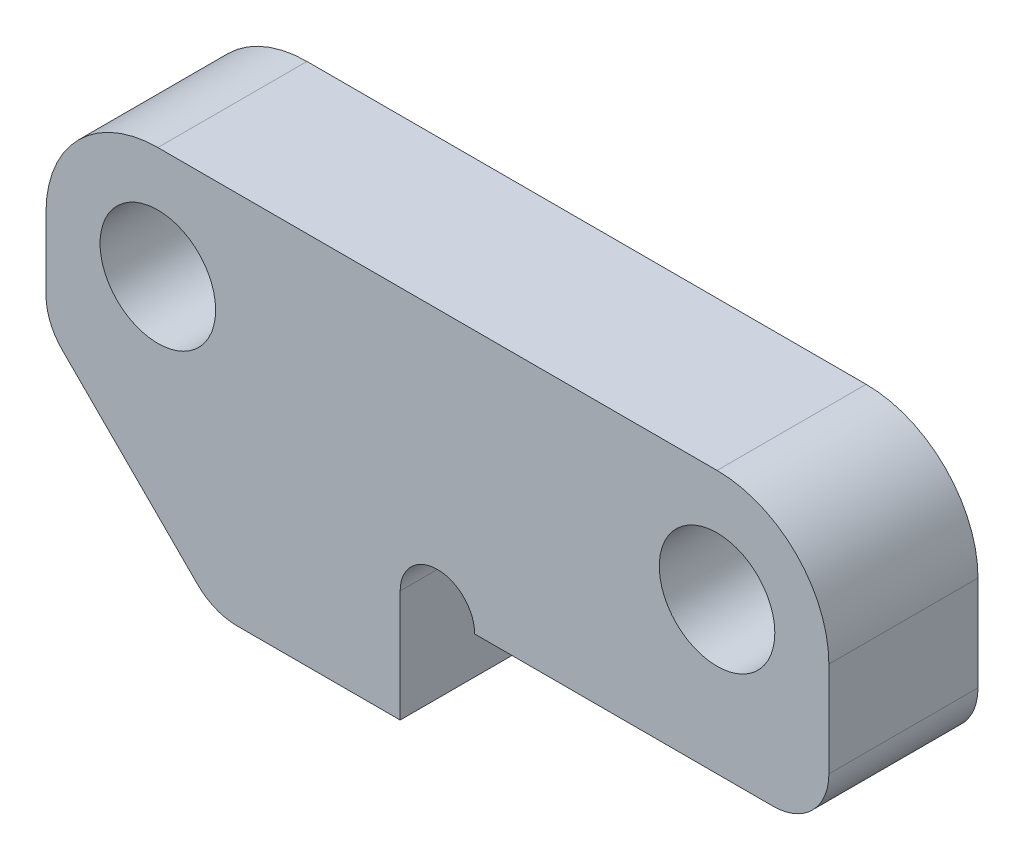
ISO-10303-21;
HEADER;
FILE_DESCRIPTION(('STEP AP214'),'2;1');
FILE_NAME('part.step','',(''),(''),'','','');
FILE_SCHEMA(('AUTOMOTIVE_DESIGN { 1 0 10303 214 1 1 1 1 }'));
ENDSEC;
DATA;
#1=APPLICATION_CONTEXT('core data for automotive mechanical design processes');
#2=APPLICATION_PROTOCOL_DEFINITION('international standard','automotive_design',2000,#1);
#3=PRODUCT_CONTEXT('',#1,'mechanical');
#4=PRODUCT('Part','Part','',(#3));
#5=PRODUCT_RELATED_PRODUCT_CATEGORY('part','',(#4));
#6=PRODUCT_DEFINITION_FORMATION('','',#4);
#7=PRODUCT_DEFINITION_CONTEXT('part definition',#1,'design');
#8=PRODUCT_DEFINITION('design','',#6,#7);
#9=PRODUCT_DEFINITION_SHAPE('','',#8);
#10=(LENGTH_UNIT() NAMED_UNIT(*) SI_UNIT(.MILLI.,.METRE.));
#11=(NAMED_UNIT(*) PLANE_ANGLE_UNIT() SI_UNIT($,.RADIAN.));
#12=(NAMED_UNIT(*) SI_UNIT($,.STERADIAN.) SOLID_ANGLE_UNIT());
#13=UNCERTAINTY_MEASURE_WITH_UNIT(LENGTH_MEASURE(1.E-05),#10,'distance_accuracy_value','');
#14=(GEOMETRIC_REPRESENTATION_CONTEXT(3) GLOBAL_UNCERTAINTY_ASSIGNED_CONTEXT((#13)) GLOBAL_UNIT_ASSIGNED_CONTEXT((#10,
#11,#12)) REPRESENTATION_CONTEXT('',''));
#15=CARTESIAN_POINT('',(0.,0.,0.));
#16=DIRECTION('',(0.,0.,1.));
#17=DIRECTION('',(1.,0.,0.));
#18=AXIS2_PLACEMENT_3D('',#15,#16,#17);
#19=CARTESIAN_POINT('',(0.,0.,2.));
#20=DIRECTION('',(0.,0.,-1.));
#21=DIRECTION('',(-1.,0.,0.));
#22=AXIS2_PLACEMENT_3D('',#19,#20,#21);
#23=PLANE('',#22);
#24=DIRECTION('',(0.,1.,0.));
#25=VECTOR('',#24,1.);
#26=CARTESIAN_POINT('',(-0.999999999999999,-7.05,2.));
#27=LINE('',#26,#25);
#28=CARTESIAN_POINT('',(-0.999999999999999,-10.05,2.));
#29=VERTEX_POINT('',#28);
#30=CARTESIAN_POINT('',(-0.999999999999999,-7.05,2.));
#31=VERTEX_POINT('',#30);
#32=EDGE_CURVE('E135',#29,#31,#27,.T.);
#33=ORIENTED_EDGE('',*,*,#32,.T.);
#34=CARTESIAN_POINT('',(0.,-7.05,2.));
#35=DIRECTION('',(0.,0.,1.));
#36=DIRECTION('',(1.,0.,0.));
#37=AXIS2_PLACEMENT_3D('',#34,#35,#36);
#38=CIRCLE('',#37,1.);
#39=CARTESIAN_POINT('',(1.,-7.05,2.));
#40=VERTEX_POINT('',#39);
#41=EDGE_CURVE('E126',#40,#31,#38,.T.);
#42=ORIENTED_EDGE('',*,*,#41,.F.);
#43=DIRECTION('',(1.,0.,0.));
#44=VECTOR('',#43,1.);
#45=CARTESIAN_POINT('',(10.5,-7.05,2.));
#46=LINE('',#45,#44);
#47=CARTESIAN_POINT('',(9.,-7.05,2.));
#48=VERTEX_POINT('',#47);
#49=EDGE_CURVE('E132',#40,#48,#46,.T.);
#50=ORIENTED_EDGE('',*,*,#49,.T.);
#51=CARTESIAN_POINT('',(9.,-5.55,2.));
#52=DIRECTION('',(0.,0.,-1.));
#53=DIRECTION('',(-1.,0.,0.));
#54=AXIS2_PLACEMENT_3D('',#51,#52,#53);
#55=CIRCLE('',#54,1.5);
#56=CARTESIAN_POINT('',(10.5,-5.55,2.));
#57=VERTEX_POINT('',#56);
#58=EDGE_CURVE('E211',#48,#57,#55,.F.);
#59=ORIENTED_EDGE('',*,*,#58,.T.);
#60=DIRECTION('',(0.,1.,0.));
#61=VECTOR('',#60,1.);
#62=CARTESIAN_POINT('',(10.5,0.,2.));
#63=LINE('',#62,#61);
#64=CARTESIAN_POINT('',(10.5,-3.,2.));
#65=VERTEX_POINT('',#64);
#66=EDGE_CURVE('E142',#57,#65,#63,.T.);
#67=ORIENTED_EDGE('',*,*,#66,.T.);
#68=CARTESIAN_POINT('',(7.5,-3.,2.));
#69=DIRECTION('',(0.,0.,-1.));
#70=DIRECTION('',(-1.,0.,0.));
#71=AXIS2_PLACEMENT_3D('',#68,#69,#70);
#72=CIRCLE('',#71,3.);
#73=CARTESIAN_POINT('',(7.5,0.,2.));
#74=VERTEX_POINT('',#73);
#75=EDGE_CURVE('E190',#65,#74,#72,.F.);
#76=ORIENTED_EDGE('',*,*,#75,.T.);
#77=DIRECTION('',(-1.,0.,0.));
#78=VECTOR('',#77,1.);
#79=CARTESIAN_POINT('',(-10.5,0.,2.));
#80=LINE('',#79,#78);
#81=CARTESIAN_POINT('',(-7.5,0.,2.));
#82=VERTEX_POINT('',#81);
#83=EDGE_CURVE('E144',#74,#82,#80,.T.);
#84=ORIENTED_EDGE('',*,*,#83,.T.);
#85=CARTESIAN_POINT('',(-7.5,-3.,2.));
#86=DIRECTION('',(0.,0.,-1.));
#87=DIRECTION('',(-1.,0.,0.));
#88=AXIS2_PLACEMENT_3D('',#85,#86,#87);
#89=CIRCLE('',#88,3.);
#90=CARTESIAN_POINT('',(-10.5,-3.,2.));
#91=VERTEX_POINT('',#90);
#92=EDGE_CURVE('E192',#82,#91,#89,.F.);
#93=ORIENTED_EDGE('',*,*,#92,.T.);
#94=DIRECTION('',(0.,-1.,0.));
#95=VECTOR('',#94,1.);
#96=CARTESIAN_POINT('',(-10.5,-5.55000000000002,2.));
#97=LINE('',#96,#95);
#98=CARTESIAN_POINT('',(-10.5,-4.92867965644037,2.));
#99=VERTEX_POINT('',#98);
#100=EDGE_CURVE('E172',#91,#99,#97,.T.);
#101=ORIENTED_EDGE('',*,*,#100,.T.);
#102=CARTESIAN_POINT('',(-9.,-4.92867965644037,2.));
#103=DIRECTION('',(0.,0.,-1.));
#104=DIRECTION('',(-1.,0.,0.));
#105=AXIS2_PLACEMENT_3D('',#102,#103,#104);
#106=CIRCLE('',#105,1.5);
#107=CARTESIAN_POINT('',(-10.0606601717798,-5.98933982822019,2.));
#108=VERTEX_POINT('',#107);
#109=EDGE_CURVE('E208',#99,#108,#106,.F.);
#110=ORIENTED_EDGE('',*,*,#109,.T.);
#111=DIRECTION('',(0.707106781186549,-0.707106781186546,0.));
#112=VECTOR('',#111,1.);
#113=CARTESIAN_POINT('',(-6.,-10.05,2.));
#114=LINE('',#113,#112);
#115=CARTESIAN_POINT('',(-6.43933982822018,-9.61066017177983,2.));
#116=VERTEX_POINT('',#115);
#117=EDGE_CURVE('E231',#108,#116,#114,.T.);
#118=ORIENTED_EDGE('',*,*,#117,.T.);
#119=CARTESIAN_POINT('',(-5.37867965644036,-8.55,2.));
#120=DIRECTION('',(0.,0.,-1.));
#121=DIRECTION('',(-1.,0.,0.));
#122=AXIS2_PLACEMENT_3D('',#119,#120,#121);
#123=CIRCLE('',#122,1.5);
#124=CARTESIAN_POINT('',(-5.37867965644036,-10.05,2.));
#125=VERTEX_POINT('',#124);
#126=EDGE_CURVE('E54',#116,#125,#123,.F.);
#127=ORIENTED_EDGE('',*,*,#126,.T.);
#128=DIRECTION('',(1.,0.,0.));
#129=VECTOR('',#128,1.);
#130=CARTESIAN_POINT('',(-0.999999999999999,-10.05,2.));
#131=LINE('',#130,#129);
#132=EDGE_CURVE('E146',#125,#29,#131,.T.);
#133=ORIENTED_EDGE('',*,*,#132,.T.);
#134=EDGE_LOOP('',(#33,#42,#50,#59,#67,#76,#84,#93,#101,#110,#118,#127,#133));
#135=FACE_BOUND('',#134,.T.);
#136=CARTESIAN_POINT('',(-7.5,-3.,2.));
#137=DIRECTION('',(0.,0.,1.));
#138=DIRECTION('',(1.,0.,0.));
#139=AXIS2_PLACEMENT_3D('',#136,#137,#138);
#140=CIRCLE('',#139,1.55);
#141=CARTESIAN_POINT('',(-5.95,-3.,2.));
#142=VERTEX_POINT('',#141);
#143=EDGE_CURVE('E157',#142,#142,#140,.T.);
#144=ORIENTED_EDGE('',*,*,#143,.F.);
#145=EDGE_LOOP('',(#144));
#146=FACE_BOUND('',#145,.T.);
#147=CARTESIAN_POINT('',(7.5,-3.,2.));
#148=DIRECTION('',(0.,0.,1.));
#149=DIRECTION('',(1.,0.,0.));
#150=AXIS2_PLACEMENT_3D('',#147,#148,#149);
#151=CIRCLE('',#150,1.55);
#152=CARTESIAN_POINT('',(9.05,-3.,2.));
#153=VERTEX_POINT('',#152);
#154=EDGE_CURVE('E254',#153,#153,#151,.T.);
#155=ORIENTED_EDGE('',*,*,#154,.F.);
#156=EDGE_LOOP('',(#155));
#157=FACE_BOUND('',#156,.T.);
#158=ADVANCED_FACE('F32',(#135,#146,#157),#23,.F.);
#159=CARTESIAN_POINT('',(0.,0.,-2.));
#160=DIRECTION('',(0.,0.,-1.));
#161=DIRECTION('',(-1.,0.,0.));
#162=AXIS2_PLACEMENT_3D('',#159,#160,#161);
#163=PLANE('',#162);
#164=CARTESIAN_POINT('',(0.,-7.05,-2.));
#165=DIRECTION('',(0.,0.,1.));
#166=DIRECTION('',(1.,0.,0.));
#167=AXIS2_PLACEMENT_3D('',#164,#165,#166);
#168=CIRCLE('',#167,1.);
#169=CARTESIAN_POINT('',(1.,-7.05,-2.));
#170=VERTEX_POINT('',#169);
#171=CARTESIAN_POINT('',(-0.999999999999999,-7.05,-2.));
#172=VERTEX_POINT('',#171);
#173=EDGE_CURVE('E47',#170,#172,#168,.T.);
#174=ORIENTED_EDGE('',*,*,#173,.T.);
#175=DIRECTION('',(0.,1.,0.));
#176=VECTOR('',#175,1.);
#177=CARTESIAN_POINT('',(-0.999999999999999,-7.05,-2.));
#178=LINE('',#177,#176);
#179=CARTESIAN_POINT('',(-0.999999999999999,-10.05,-2.));
#180=VERTEX_POINT('',#179);
#181=EDGE_CURVE('E162',#180,#172,#178,.T.);
#182=ORIENTED_EDGE('',*,*,#181,.F.);
#183=DIRECTION('',(1.,0.,0.));
#184=VECTOR('',#183,1.);
#185=CARTESIAN_POINT('',(-0.999999999999999,-10.05,-2.));
#186=LINE('',#185,#184);
#187=CARTESIAN_POINT('',(-5.37867965644036,-10.05,-2.));
#188=VERTEX_POINT('',#187);
#189=EDGE_CURVE('E160',#188,#180,#186,.T.);
#190=ORIENTED_EDGE('',*,*,#189,.F.);
#191=CARTESIAN_POINT('',(-5.37867965644036,-8.55,-2.));
#192=DIRECTION('',(0.,0.,-1.));
#193=DIRECTION('',(-1.,0.,0.));
#194=AXIS2_PLACEMENT_3D('',#191,#192,#193);
#195=CIRCLE('',#194,1.5);
#196=CARTESIAN_POINT('',(-6.43933982822018,-9.61066017177983,-2.));
#197=VERTEX_POINT('',#196);
#198=EDGE_CURVE('E202',#188,#197,#195,.T.);
#199=ORIENTED_EDGE('',*,*,#198,.T.);
#200=DIRECTION('',(0.707106781186549,-0.707106781186546,0.));
#201=VECTOR('',#200,1.);
#202=CARTESIAN_POINT('',(-6.,-10.05,-2.));
#203=LINE('',#202,#201);
#204=CARTESIAN_POINT('',(-10.0606601717798,-5.98933982822019,-2.));
#205=VERTEX_POINT('',#204);
#206=EDGE_CURVE('E156',#205,#197,#203,.T.);
#207=ORIENTED_EDGE('',*,*,#206,.F.);
#208=CARTESIAN_POINT('',(-9.,-4.92867965644037,-2.));
#209=DIRECTION('',(0.,0.,-1.));
#210=DIRECTION('',(-1.,0.,0.));
#211=AXIS2_PLACEMENT_3D('',#208,#209,#210);
#212=CIRCLE('',#211,1.5);
#213=CARTESIAN_POINT('',(-10.5,-4.92867965644037,-2.));
#214=VERTEX_POINT('',#213);
#215=EDGE_CURVE('E200',#205,#214,#212,.T.);
#216=ORIENTED_EDGE('',*,*,#215,.T.);
#217=DIRECTION('',(0.,-1.,0.));
#218=VECTOR('',#217,1.);
#219=CARTESIAN_POINT('',(-10.5,-5.55000000000002,-2.));
#220=LINE('',#219,#218);
#221=CARTESIAN_POINT('',(-10.5,-3.,-2.));
#222=VERTEX_POINT('',#221);
#223=EDGE_CURVE('E153',#222,#214,#220,.T.);
#224=ORIENTED_EDGE('',*,*,#223,.F.);
#225=CARTESIAN_POINT('',(-7.5,-3.,-2.));
#226=DIRECTION('',(0.,0.,-1.));
#227=DIRECTION('',(-1.,0.,0.));
#228=AXIS2_PLACEMENT_3D('',#225,#226,#227);
#229=CIRCLE('',#228,3.);
#230=CARTESIAN_POINT('',(-7.5,0.,-2.));
#231=VERTEX_POINT('',#230);
#232=EDGE_CURVE('E183',#222,#231,#229,.T.);
#233=ORIENTED_EDGE('',*,*,#232,.T.);
#234=DIRECTION('',(-1.,0.,0.));
#235=VECTOR('',#234,1.);
#236=CARTESIAN_POINT('',(-10.5,0.,-2.));
#237=LINE('',#236,#235);
#238=CARTESIAN_POINT('',(7.5,0.,-2.));
#239=VERTEX_POINT('',#238);
#240=EDGE_CURVE('E169',#239,#231,#237,.T.);
#241=ORIENTED_EDGE('',*,*,#240,.F.);
#242=CARTESIAN_POINT('',(7.5,-3.,-2.));
#243=DIRECTION('',(0.,0.,-1.));
#244=DIRECTION('',(-1.,0.,0.));
#245=AXIS2_PLACEMENT_3D('',#242,#243,#244);
#246=CIRCLE('',#245,3.);
#247=CARTESIAN_POINT('',(10.5,-3.,-2.));
#248=VERTEX_POINT('',#247);
#249=EDGE_CURVE('E180',#239,#248,#246,.T.);
#250=ORIENTED_EDGE('',*,*,#249,.T.);
#251=DIRECTION('',(0.,1.,0.));
#252=VECTOR('',#251,1.);
#253=CARTESIAN_POINT('',(10.5,0.,-2.));
#254=LINE('',#253,#252);
#255=CARTESIAN_POINT('',(10.5,-5.55,-2.));
#256=VERTEX_POINT('',#255);
#257=EDGE_CURVE('E167',#256,#248,#254,.T.);
#258=ORIENTED_EDGE('',*,*,#257,.F.);
#259=CARTESIAN_POINT('',(9.,-5.55,-2.));
#260=DIRECTION('',(0.,0.,-1.));
#261=DIRECTION('',(-1.,0.,0.));
#262=AXIS2_PLACEMENT_3D('',#259,#260,#261);
#263=CIRCLE('',#262,1.5);
#264=CARTESIAN_POINT('',(9.,-7.05,-2.));
#265=VERTEX_POINT('',#264);
#266=EDGE_CURVE('E204',#256,#265,#263,.T.);
#267=ORIENTED_EDGE('',*,*,#266,.T.);
#268=DIRECTION('',(1.,0.,0.));
#269=VECTOR('',#268,1.);
#270=CARTESIAN_POINT('',(10.5,-7.05,-2.));
#271=LINE('',#270,#269);
#272=EDGE_CURVE('E165',#170,#265,#271,.T.);
#273=ORIENTED_EDGE('',*,*,#272,.F.);
#274=EDGE_LOOP('',(#174,#182,#190,#199,#207,#216,#224,#233,#241,#250,#258,#267,#273));
#275=FACE_BOUND('',#274,.T.);
#276=CARTESIAN_POINT('',(-7.5,-3.,-2.));
#277=DIRECTION('',(0.,0.,1.));
#278=DIRECTION('',(1.,0.,0.));
#279=AXIS2_PLACEMENT_3D('',#276,#277,#278);
#280=CIRCLE('',#279,1.55);
#281=CARTESIAN_POINT('',(-5.95,-3.,-2.));
#282=VERTEX_POINT('',#281);
#283=EDGE_CURVE('E251',#282,#282,#280,.T.);
#284=ORIENTED_EDGE('',*,*,#283,.T.);
#285=EDGE_LOOP('',(#284));
#286=FACE_BOUND('',#285,.T.);
#287=CARTESIAN_POINT('',(7.5,-3.,-2.));
#288=DIRECTION('',(0.,0.,1.));
#289=DIRECTION('',(1.,0.,0.));
#290=AXIS2_PLACEMENT_3D('',#287,#288,#289);
#291=CIRCLE('',#290,1.55);
#292=CARTESIAN_POINT('',(9.05,-3.,-2.));
#293=VERTEX_POINT('',#292);
#294=EDGE_CURVE('E257',#293,#293,#291,.T.);
#295=ORIENTED_EDGE('',*,*,#294,.T.);
#296=EDGE_LOOP('',(#295));
#297=FACE_BOUND('',#296,.T.);
#298=ADVANCED_FACE('F239',(#275,#286,#297),#163,.T.);
#299=CARTESIAN_POINT('',(-10.5,-5.55000000000002,2.));
#300=DIRECTION('',(1.,0.,0.));
#301=DIRECTION('',(0.,0.,-1.));
#302=AXIS2_PLACEMENT_3D('',#299,#300,#301);
#303=PLANE('',#302);
#304=ORIENTED_EDGE('',*,*,#223,.T.);
#305=DIRECTION('',(0.,0.,-1.));
#306=VECTOR('',#305,1.);
#307=CARTESIAN_POINT('',(-10.5,-4.92867965644037,2.));
#308=LINE('',#307,#306);
#309=EDGE_CURVE('E40',#214,#99,#308,.F.);
#310=ORIENTED_EDGE('',*,*,#309,.T.);
#311=ORIENTED_EDGE('',*,*,#100,.F.);
#312=DIRECTION('',(0.,0.,-1.));
#313=VECTOR('',#312,1.);
#314=CARTESIAN_POINT('',(-10.5,-3.,2.));
#315=LINE('',#314,#313);
#316=EDGE_CURVE('E177',#91,#222,#315,.T.);
#317=ORIENTED_EDGE('',*,*,#316,.T.);
#318=EDGE_LOOP('',(#304,#310,#311,#317));
#319=FACE_BOUND('',#318,.T.);
#320=ADVANCED_FACE('F224',(#319),#303,.F.);
#321=CARTESIAN_POINT('',(-6.,-10.05,2.));
#322=DIRECTION('',(0.707106781186546,0.707106781186549,0.));
#323=DIRECTION('',(-0.707106781186549,0.707106781186546,0.));
#324=AXIS2_PLACEMENT_3D('',#321,#322,#323);
#325=PLANE('',#324);
#326=ORIENTED_EDGE('',*,*,#206,.T.);
#327=DIRECTION('',(0.,0.,-1.));
#328=VECTOR('',#327,1.);
#329=CARTESIAN_POINT('',(-6.43933982822018,-9.61066017177983,2.));
#330=LINE('',#329,#328);
#331=EDGE_CURVE('E219',#197,#116,#330,.F.);
#332=ORIENTED_EDGE('',*,*,#331,.T.);
#333=ORIENTED_EDGE('',*,*,#117,.F.);
#334=DIRECTION('',(0.,0.,-1.));
#335=VECTOR('',#334,1.);
#336=CARTESIAN_POINT('',(-10.0606601717798,-5.98933982822019,2.));
#337=LINE('',#336,#335);
#338=EDGE_CURVE('E216',#108,#205,#337,.T.);
#339=ORIENTED_EDGE('',*,*,#338,.T.);
#340=EDGE_LOOP('',(#326,#332,#333,#339));
#341=FACE_BOUND('',#340,.T.);
#342=ADVANCED_FACE('F236',(#341),#325,.F.);
#343=CARTESIAN_POINT('',(-0.999999999999999,-10.05,2.));
#344=DIRECTION('',(0.,1.,0.));
#345=DIRECTION('',(0.,0.,1.));
#346=AXIS2_PLACEMENT_3D('',#343,#344,#345);
#347=PLANE('',#346);
#348=ORIENTED_EDGE('',*,*,#132,.F.);
#349=DIRECTION('',(0.,0.,-1.));
#350=VECTOR('',#349,1.);
#351=CARTESIAN_POINT('',(-5.37867965644036,-10.05,2.));
#352=LINE('',#351,#350);
#353=EDGE_CURVE('E213',#125,#188,#352,.T.);
#354=ORIENTED_EDGE('',*,*,#353,.T.);
#355=ORIENTED_EDGE('',*,*,#189,.T.);
#356=DIRECTION('',(0.,0.,-1.));
#357=VECTOR('',#356,1.);
#358=CARTESIAN_POINT('',(-0.999999999999999,-10.05,2.));
#359=LINE('',#358,#357);
#360=EDGE_CURVE('E174',#29,#180,#359,.T.);
#361=ORIENTED_EDGE('',*,*,#360,.F.);
#362=EDGE_LOOP('',(#348,#354,#355,#361));
#363=FACE_BOUND('',#362,.T.);
#364=ADVANCED_FACE('F247',(#363),#347,.F.);
#365=CARTESIAN_POINT('',(-0.999999999999999,-7.05,2.));
#366=DIRECTION('',(-1.,0.,0.));
#367=DIRECTION('',(0.,-1.,0.));
#368=AXIS2_PLACEMENT_3D('',#365,#366,#367);
#369=PLANE('',#368);
#370=ORIENTED_EDGE('',*,*,#181,.T.);
#371=DIRECTION('',(0.,0.,-1.));
#372=VECTOR('',#371,1.);
#373=CARTESIAN_POINT('',(-0.999999999999999,-7.05,2.));
#374=LINE('',#373,#372);
#375=EDGE_CURVE('E152',#31,#172,#374,.T.);
#376=ORIENTED_EDGE('',*,*,#375,.F.);
#377=ORIENTED_EDGE('',*,*,#32,.F.);
#378=ORIENTED_EDGE('',*,*,#360,.T.);
#379=EDGE_LOOP('',(#370,#376,#377,#378));
#380=FACE_BOUND('',#379,.T.);
#381=ADVANCED_FACE('F263',(#380),#369,.F.);
#382=CARTESIAN_POINT('',(10.5,-7.05,2.));
#383=DIRECTION('',(0.,1.,0.));
#384=DIRECTION('',(-1.,0.,0.));
#385=AXIS2_PLACEMENT_3D('',#382,#383,#384);
#386=PLANE('',#385);
#387=ORIENTED_EDGE('',*,*,#49,.F.);
#388=DIRECTION('',(0.,0.,1.));
#389=VECTOR('',#388,1.);
#390=CARTESIAN_POINT('',(1.,-7.05,-2.));
#391=LINE('',#390,#389);
#392=EDGE_CURVE('E11',#40,#170,#391,.F.);
#393=ORIENTED_EDGE('',*,*,#392,.T.);
#394=ORIENTED_EDGE('',*,*,#272,.T.);
#395=DIRECTION('',(0.,0.,-1.));
#396=VECTOR('',#395,1.);
#397=CARTESIAN_POINT('',(9.,-7.05,2.));
#398=LINE('',#397,#396);
#399=EDGE_CURVE('E140',#265,#48,#398,.F.);
#400=ORIENTED_EDGE('',*,*,#399,.T.);
#401=EDGE_LOOP('',(#387,#393,#394,#400));
#402=FACE_BOUND('',#401,.T.);
#403=ADVANCED_FACE('F138',(#402),#386,.F.);
#404=CARTESIAN_POINT('',(10.5,0.,2.));
#405=DIRECTION('',(-1.,0.,0.));
#406=DIRECTION('',(0.,-1.,0.));
#407=AXIS2_PLACEMENT_3D('',#404,#405,#406);
#408=PLANE('',#407);
#409=ORIENTED_EDGE('',*,*,#66,.F.);
#410=DIRECTION('',(0.,0.,-1.));
#411=VECTOR('',#410,1.);
#412=CARTESIAN_POINT('',(10.5,-5.55,2.));
#413=LINE('',#412,#411);
#414=EDGE_CURVE('E197',#57,#256,#413,.T.);
#415=ORIENTED_EDGE('',*,*,#414,.T.);
#416=ORIENTED_EDGE('',*,*,#257,.T.);
#417=DIRECTION('',(0.,0.,-1.));
#418=VECTOR('',#417,1.);
#419=CARTESIAN_POINT('',(10.5,-3.,2.));
#420=LINE('',#419,#418);
#421=EDGE_CURVE('E194',#248,#65,#420,.F.);
#422=ORIENTED_EDGE('',*,*,#421,.T.);
#423=EDGE_LOOP('',(#409,#415,#416,#422));
#424=FACE_BOUND('',#423,.T.);
#425=ADVANCED_FACE('F270',(#424),#408,.F.);
#426=CARTESIAN_POINT('',(-10.5,0.,2.));
#427=DIRECTION('',(0.,-1.,0.));
#428=DIRECTION('',(0.,0.,-1.));
#429=AXIS2_PLACEMENT_3D('',#426,#427,#428);
#430=PLANE('',#429);
#431=ORIENTED_EDGE('',*,*,#240,.T.);
#432=DIRECTION('',(0.,0.,-1.));
#433=VECTOR('',#432,1.);
#434=CARTESIAN_POINT('',(-7.5,0.,2.));
#435=LINE('',#434,#433);
#436=EDGE_CURVE('E188',#231,#82,#435,.F.);
#437=ORIENTED_EDGE('',*,*,#436,.T.);
#438=ORIENTED_EDGE('',*,*,#83,.F.);
#439=DIRECTION('',(0.,0.,-1.));
#440=VECTOR('',#439,1.);
#441=CARTESIAN_POINT('',(7.5,0.,2.));
#442=LINE('',#441,#440);
#443=EDGE_CURVE('E185',#74,#239,#442,.T.);
#444=ORIENTED_EDGE('',*,*,#443,.T.);
#445=EDGE_LOOP('',(#431,#437,#438,#444));
#446=FACE_BOUND('',#445,.T.);
#447=ADVANCED_FACE('F283',(#446),#430,.F.);
#448=CARTESIAN_POINT('',(-7.5,-3.,2.));
#449=DIRECTION('',(0.,0.,-1.));
#450=DIRECTION('',(-1.,0.,0.));
#451=AXIS2_PLACEMENT_3D('',#448,#449,#450);
#452=CYLINDRICAL_SURFACE('',#451,1.55);
#453=ORIENTED_EDGE('',*,*,#143,.T.);
#454=EDGE_LOOP('',(#453));
#455=FACE_BOUND('',#454,.T.);
#456=ORIENTED_EDGE('',*,*,#283,.F.);
#457=EDGE_LOOP('',(#456));
#458=FACE_BOUND('',#457,.T.);
#459=ADVANCED_FACE('F280',(#455,#458),#452,.F.);
#460=CARTESIAN_POINT('',(7.5,-3.,2.));
#461=DIRECTION('',(0.,0.,-1.));
#462=DIRECTION('',(-1.,0.,0.));
#463=AXIS2_PLACEMENT_3D('',#460,#461,#462);
#464=CYLINDRICAL_SURFACE('',#463,1.55);
#465=ORIENTED_EDGE('',*,*,#154,.T.);
#466=EDGE_LOOP('',(#465));
#467=FACE_BOUND('',#466,.T.);
#468=ORIENTED_EDGE('',*,*,#294,.F.);
#469=EDGE_LOOP('',(#468));
#470=FACE_BOUND('',#469,.T.);
#471=ADVANCED_FACE('F307',(#467,#470),#464,.F.);
#472=CARTESIAN_POINT('',(-7.5,-3.,2.));
#473=DIRECTION('',(0.,0.,-1.));
#474=DIRECTION('',(-1.,0.,0.));
#475=AXIS2_PLACEMENT_3D('',#472,#473,#474);
#476=CYLINDRICAL_SURFACE('',#475,3.);
#477=ORIENTED_EDGE('',*,*,#92,.F.);
#478=ORIENTED_EDGE('',*,*,#436,.F.);
#479=ORIENTED_EDGE('',*,*,#232,.F.);
#480=ORIENTED_EDGE('',*,*,#316,.F.);
#481=EDGE_LOOP('',(#477,#478,#479,#480));
#482=FACE_BOUND('',#481,.T.);
#483=ADVANCED_FACE('F305',(#482),#476,.T.);
#484=CARTESIAN_POINT('',(7.5,-3.,2.));
#485=DIRECTION('',(0.,0.,-1.));
#486=DIRECTION('',(-1.,0.,0.));
#487=AXIS2_PLACEMENT_3D('',#484,#485,#486);
#488=CYLINDRICAL_SURFACE('',#487,3.);
#489=ORIENTED_EDGE('',*,*,#75,.F.);
#490=ORIENTED_EDGE('',*,*,#421,.F.);
#491=ORIENTED_EDGE('',*,*,#249,.F.);
#492=ORIENTED_EDGE('',*,*,#443,.F.);
#493=EDGE_LOOP('',(#489,#490,#491,#492));
#494=FACE_BOUND('',#493,.T.);
#495=ADVANCED_FACE('F301',(#494),#488,.T.);
#496=CARTESIAN_POINT('',(9.,-5.55,2.));
#497=DIRECTION('',(0.,0.,-1.));
#498=DIRECTION('',(-1.,0.,0.));
#499=AXIS2_PLACEMENT_3D('',#496,#497,#498);
#500=CYLINDRICAL_SURFACE('',#499,1.5);
#501=ORIENTED_EDGE('',*,*,#58,.F.);
#502=ORIENTED_EDGE('',*,*,#399,.F.);
#503=ORIENTED_EDGE('',*,*,#266,.F.);
#504=ORIENTED_EDGE('',*,*,#414,.F.);
#505=EDGE_LOOP('',(#501,#502,#503,#504));
#506=FACE_BOUND('',#505,.T.);
#507=ADVANCED_FACE('F297',(#506),#500,.T.);
#508=CARTESIAN_POINT('',(-5.37867965644036,-8.55,2.));
#509=DIRECTION('',(0.,0.,-1.));
#510=DIRECTION('',(-1.,0.,0.));
#511=AXIS2_PLACEMENT_3D('',#508,#509,#510);
#512=CYLINDRICAL_SURFACE('',#511,1.5);
#513=ORIENTED_EDGE('',*,*,#126,.F.);
#514=ORIENTED_EDGE('',*,*,#331,.F.);
#515=ORIENTED_EDGE('',*,*,#198,.F.);
#516=ORIENTED_EDGE('',*,*,#353,.F.);
#517=EDGE_LOOP('',(#513,#514,#515,#516));
#518=FACE_BOUND('',#517,.T.);
#519=ADVANCED_FACE('F245',(#518),#512,.T.);
#520=CARTESIAN_POINT('',(-9.,-4.92867965644037,2.));
#521=DIRECTION('',(0.,0.,-1.));
#522=DIRECTION('',(-1.,0.,0.));
#523=AXIS2_PLACEMENT_3D('',#520,#521,#522);
#524=CYLINDRICAL_SURFACE('',#523,1.5);
#525=ORIENTED_EDGE('',*,*,#109,.F.);
#526=ORIENTED_EDGE('',*,*,#309,.F.);
#527=ORIENTED_EDGE('',*,*,#215,.F.);
#528=ORIENTED_EDGE('',*,*,#338,.F.);
#529=EDGE_LOOP('',(#525,#526,#527,#528));
#530=FACE_BOUND('',#529,.T.);
#531=ADVANCED_FACE('F34',(#530),#524,.T.);
#532=CARTESIAN_POINT('',(0.,-7.05,-2.));
#533=DIRECTION('',(0.,0.,1.));
#534=DIRECTION('',(1.,0.,0.));
#535=AXIS2_PLACEMENT_3D('',#532,#533,#534);
#536=CYLINDRICAL_SURFACE('',#535,1.);
#537=ORIENTED_EDGE('',*,*,#173,.F.);
#538=ORIENTED_EDGE('',*,*,#392,.F.);
#539=ORIENTED_EDGE('',*,*,#41,.T.);
#540=ORIENTED_EDGE('',*,*,#375,.T.);
#541=EDGE_LOOP('',(#537,#538,#539,#540));
#542=FACE_BOUND('',#541,.T.);
#543=ADVANCED_FACE('F125',(#542),#536,.F.);
#544=CLOSED_SHELL('',(#158,#298,#320,#342,#364,#381,#403,#425,#447,#459,#471,#483,#495,#507,
#519,#531,#543));
#545=MANIFOLD_SOLID_BREP('B2',#544);
#546=ADVANCED_BREP_SHAPE_REPRESENTATION('',(#18,#545),#14);
#547=SHAPE_DEFINITION_REPRESENTATION(#9,#546);
ENDSEC;
END-ISO-10303-21;
